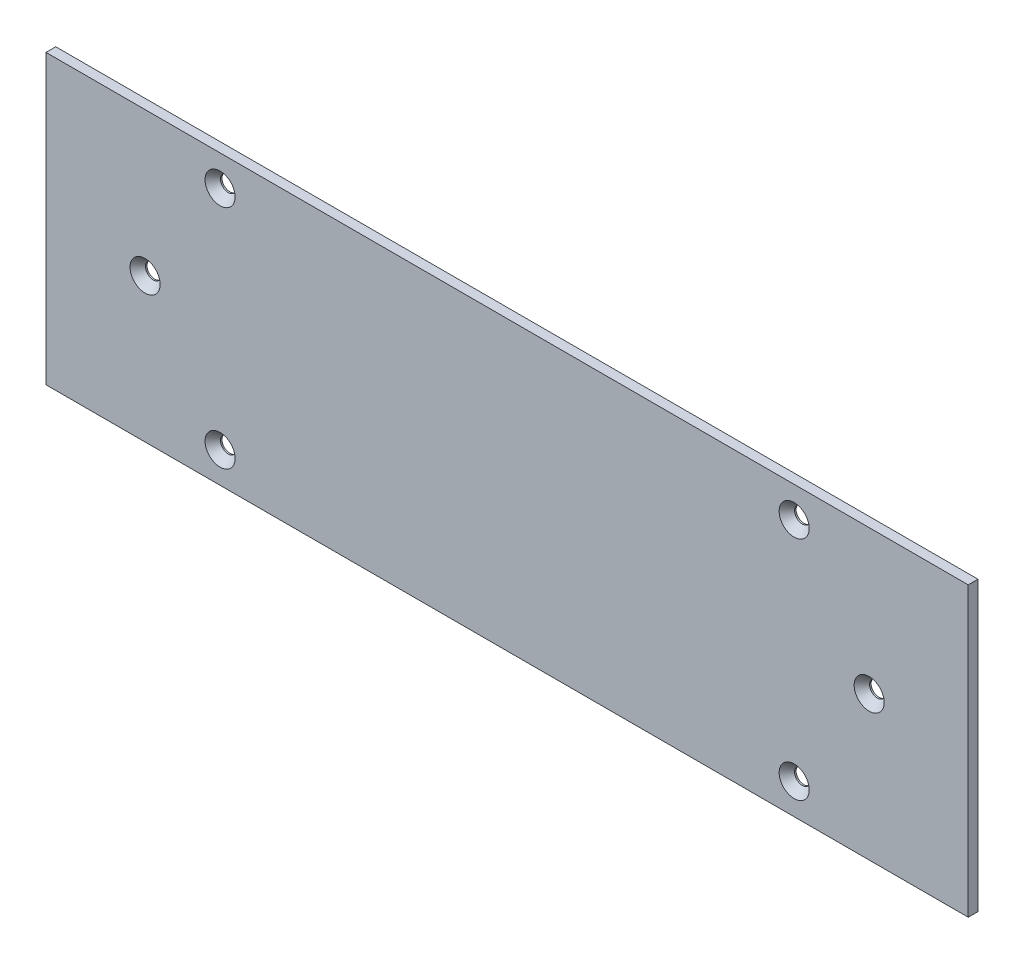
ISO-10303-21;
HEADER;
FILE_DESCRIPTION(('STEP AP214'),'2;1');
FILE_NAME('part.step','',(''),(''),'','','');
FILE_SCHEMA(('AUTOMOTIVE_DESIGN { 1 0 10303 214 1 1 1 1 }'));
ENDSEC;
DATA;
#1=APPLICATION_CONTEXT('core data for automotive mechanical design processes');
#2=APPLICATION_PROTOCOL_DEFINITION('international standard','automotive_design',2000,#1);
#3=PRODUCT_CONTEXT('',#1,'mechanical');
#4=PRODUCT('Part','Part','',(#3));
#5=PRODUCT_RELATED_PRODUCT_CATEGORY('part','',(#4));
#6=PRODUCT_DEFINITION_FORMATION('','',#4);
#7=PRODUCT_DEFINITION_CONTEXT('part definition',#1,'design');
#8=PRODUCT_DEFINITION('design','',#6,#7);
#9=PRODUCT_DEFINITION_SHAPE('','',#8);
#10=(LENGTH_UNIT() NAMED_UNIT(*) SI_UNIT(.MILLI.,.METRE.));
#11=(NAMED_UNIT(*) PLANE_ANGLE_UNIT() SI_UNIT($,.RADIAN.));
#12=(NAMED_UNIT(*) SI_UNIT($,.STERADIAN.) SOLID_ANGLE_UNIT());
#13=UNCERTAINTY_MEASURE_WITH_UNIT(LENGTH_MEASURE(1.E-05),#10,'distance_accuracy_value','');
#14=(GEOMETRIC_REPRESENTATION_CONTEXT(3) GLOBAL_UNCERTAINTY_ASSIGNED_CONTEXT((#13)) GLOBAL_UNIT_ASSIGNED_CONTEXT((#10,
#11,#12)) REPRESENTATION_CONTEXT('',''));
#15=CARTESIAN_POINT('',(0.,0.,0.));
#16=DIRECTION('',(0.,0.,1.));
#17=DIRECTION('',(1.,0.,0.));
#18=AXIS2_PLACEMENT_3D('',#15,#16,#17);
#19=CARTESIAN_POINT('',(149.999999847,-46.824999949,3.175));
#20=DIRECTION('',(-1.,0.,0.));
#21=DIRECTION('',(0.,0.,1.));
#22=AXIS2_PLACEMENT_3D('',#19,#20,#21);
#23=PLANE('',#22);
#24=DIRECTION('',(0.,1.,0.));
#25=VECTOR('',#24,1.);
#26=CARTESIAN_POINT('',(149.999999847,-46.824999949,0.));
#27=LINE('',#26,#25);
#28=CARTESIAN_POINT('',(149.999999847,-46.824999949,0.));
#29=VERTEX_POINT('',#28);
#30=CARTESIAN_POINT('',(149.999999847,46.824999949,0.));
#31=VERTEX_POINT('',#30);
#32=EDGE_CURVE('E105',#29,#31,#27,.T.);
#33=ORIENTED_EDGE('',*,*,#32,.T.);
#34=DIRECTION('',(0.,0.,-1.));
#35=VECTOR('',#34,1.);
#36=CARTESIAN_POINT('',(149.999999847,46.824999949,3.175));
#37=LINE('',#36,#35);
#38=CARTESIAN_POINT('',(149.999999847,46.824999949,3.175));
#39=VERTEX_POINT('',#38);
#40=EDGE_CURVE('E11',#39,#31,#37,.T.);
#41=ORIENTED_EDGE('',*,*,#40,.F.);
#42=DIRECTION('',(0.,1.,0.));
#43=VECTOR('',#42,1.);
#44=CARTESIAN_POINT('',(149.999999847,-46.824999949,3.175));
#45=LINE('',#44,#43);
#46=CARTESIAN_POINT('',(149.999999847,-46.824999949,3.175));
#47=VERTEX_POINT('',#46);
#48=EDGE_CURVE('E92',#47,#39,#45,.T.);
#49=ORIENTED_EDGE('',*,*,#48,.F.);
#50=DIRECTION('',(0.,0.,-1.));
#51=VECTOR('',#50,1.);
#52=CARTESIAN_POINT('',(149.999999847,-46.824999949,3.175));
#53=LINE('',#52,#51);
#54=EDGE_CURVE('E101',#47,#29,#53,.T.);
#55=ORIENTED_EDGE('',*,*,#54,.T.);
#56=EDGE_LOOP('',(#33,#41,#49,#55));
#57=FACE_BOUND('',#56,.T.);
#58=ADVANCED_FACE('F39',(#57),#23,.F.);
#59=CARTESIAN_POINT('',(-149.999999847,46.824999949,3.175));
#60=DIRECTION('',(0.,-1.,0.));
#61=DIRECTION('',(0.,0.,-1.));
#62=AXIS2_PLACEMENT_3D('',#59,#60,#61);
#63=PLANE('',#62);
#64=DIRECTION('',(-1.,0.,0.));
#65=VECTOR('',#64,1.);
#66=CARTESIAN_POINT('',(-149.999999847,46.824999949,0.));
#67=LINE('',#66,#65);
#68=CARTESIAN_POINT('',(-149.999999847,46.824999949,0.));
#69=VERTEX_POINT('',#68);
#70=EDGE_CURVE('E96',#31,#69,#67,.T.);
#71=ORIENTED_EDGE('',*,*,#70,.T.);
#72=DIRECTION('',(0.,0.,-1.));
#73=VECTOR('',#72,1.);
#74=CARTESIAN_POINT('',(-149.999999847,46.824999949,3.175));
#75=LINE('',#74,#73);
#76=CARTESIAN_POINT('',(-149.999999847,46.824999949,3.175));
#77=VERTEX_POINT('',#76);
#78=EDGE_CURVE('E48',#77,#69,#75,.T.);
#79=ORIENTED_EDGE('',*,*,#78,.F.);
#80=DIRECTION('',(-1.,0.,0.));
#81=VECTOR('',#80,1.);
#82=CARTESIAN_POINT('',(-149.999999847,46.824999949,3.175));
#83=LINE('',#82,#81);
#84=EDGE_CURVE('E87',#39,#77,#83,.T.);
#85=ORIENTED_EDGE('',*,*,#84,.F.);
#86=ORIENTED_EDGE('',*,*,#40,.T.);
#87=EDGE_LOOP('',(#71,#79,#85,#86));
#88=FACE_BOUND('',#87,.T.);
#89=ADVANCED_FACE('F95',(#88),#63,.F.);
#90=CARTESIAN_POINT('',(-149.999999847,-46.824999949,3.175));
#91=DIRECTION('',(1.,0.,0.));
#92=DIRECTION('',(0.,0.,-1.));
#93=AXIS2_PLACEMENT_3D('',#90,#91,#92);
#94=PLANE('',#93);
#95=DIRECTION('',(0.,-1.,0.));
#96=VECTOR('',#95,1.);
#97=CARTESIAN_POINT('',(-149.999999847,-46.824999949,0.));
#98=LINE('',#97,#96);
#99=CARTESIAN_POINT('',(-149.999999847,-46.824999949,0.));
#100=VERTEX_POINT('',#99);
#101=EDGE_CURVE('E74',#69,#100,#98,.T.);
#102=ORIENTED_EDGE('',*,*,#101,.T.);
#103=DIRECTION('',(0.,0.,-1.));
#104=VECTOR('',#103,1.);
#105=CARTESIAN_POINT('',(-149.999999847,-46.824999949,3.175));
#106=LINE('',#105,#104);
#107=CARTESIAN_POINT('',(-149.999999847,-46.824999949,3.175));
#108=VERTEX_POINT('',#107);
#109=EDGE_CURVE('E97',#108,#100,#106,.T.);
#110=ORIENTED_EDGE('',*,*,#109,.F.);
#111=DIRECTION('',(0.,-1.,0.));
#112=VECTOR('',#111,1.);
#113=CARTESIAN_POINT('',(-149.999999847,-46.824999949,3.175));
#114=LINE('',#113,#112);
#115=EDGE_CURVE('E90',#77,#108,#114,.T.);
#116=ORIENTED_EDGE('',*,*,#115,.F.);
#117=ORIENTED_EDGE('',*,*,#78,.T.);
#118=EDGE_LOOP('',(#102,#110,#116,#117));
#119=FACE_BOUND('',#118,.T.);
#120=ADVANCED_FACE('F99',(#119),#94,.F.);
#121=CARTESIAN_POINT('',(-149.999999847,-46.824999949,3.175));
#122=DIRECTION('',(0.,1.,0.));
#123=DIRECTION('',(0.,0.,1.));
#124=AXIS2_PLACEMENT_3D('',#121,#122,#123);
#125=PLANE('',#124);
#126=DIRECTION('',(1.,0.,0.));
#127=VECTOR('',#126,1.);
#128=CARTESIAN_POINT('',(-149.999999847,-46.824999949,0.));
#129=LINE('',#128,#127);
#130=EDGE_CURVE('E80',#100,#29,#129,.T.);
#131=ORIENTED_EDGE('',*,*,#130,.T.);
#132=ORIENTED_EDGE('',*,*,#54,.F.);
#133=DIRECTION('',(1.,0.,0.));
#134=VECTOR('',#133,1.);
#135=CARTESIAN_POINT('',(-149.999999847,-46.824999949,3.175));
#136=LINE('',#135,#134);
#137=EDGE_CURVE('E57',#108,#47,#136,.T.);
#138=ORIENTED_EDGE('',*,*,#137,.F.);
#139=ORIENTED_EDGE('',*,*,#109,.T.);
#140=EDGE_LOOP('',(#131,#132,#138,#139));
#141=FACE_BOUND('',#140,.T.);
#142=ADVANCED_FACE('F174',(#141),#125,.F.);
#143=CARTESIAN_POINT('',(0.,0.,3.175));
#144=DIRECTION('',(0.,0.,-1.));
#145=DIRECTION('',(-1.,0.,0.));
#146=AXIS2_PLACEMENT_3D('',#143,#144,#145);
#147=PLANE('',#146);
#148=CARTESIAN_POINT('',(-117.774999847,0.,3.175));
#149=DIRECTION('',(0.,0.,1.));
#150=DIRECTION('',(1.,0.,0.));
#151=AXIS2_PLACEMENT_3D('',#148,#149,#150);
#152=CIRCLE('',#151,4.88950000000001);
#153=CARTESIAN_POINT('',(-112.885499847,0.,3.175));
#154=VERTEX_POINT('',#153);
#155=EDGE_CURVE('E319',#154,#154,#152,.T.);
#156=ORIENTED_EDGE('',*,*,#155,.F.);
#157=EDGE_LOOP('',(#156));
#158=FACE_BOUND('',#157,.T.);
#159=CARTESIAN_POINT('',(117.774999847,0.,3.175));
#160=DIRECTION('',(0.,0.,1.));
#161=DIRECTION('',(1.,0.,0.));
#162=AXIS2_PLACEMENT_3D('',#159,#160,#161);
#163=CIRCLE('',#162,4.88950000000001);
#164=CARTESIAN_POINT('',(122.664499847,0.,3.175));
#165=VERTEX_POINT('',#164);
#166=EDGE_CURVE('E140',#165,#165,#163,.T.);
#167=ORIENTED_EDGE('',*,*,#166,.F.);
#168=EDGE_LOOP('',(#167));
#169=FACE_BOUND('',#168,.T.);
#170=CARTESIAN_POINT('',(-93.3749998469957,36.824999949,3.175));
#171=DIRECTION('',(0.,0.,1.));
#172=DIRECTION('',(1.,0.,0.));
#173=AXIS2_PLACEMENT_3D('',#170,#171,#172);
#174=CIRCLE('',#173,4.88950000000001);
#175=CARTESIAN_POINT('',(-88.4854998469957,36.824999949,3.175));
#176=VERTEX_POINT('',#175);
#177=EDGE_CURVE('E133',#176,#176,#174,.T.);
#178=ORIENTED_EDGE('',*,*,#177,.F.);
#179=EDGE_LOOP('',(#178));
#180=FACE_BOUND('',#179,.T.);
#181=CARTESIAN_POINT('',(93.3749998470048,36.8249999490002,3.175));
#182=DIRECTION('',(0.,0.,1.));
#183=DIRECTION('',(1.,0.,0.));
#184=AXIS2_PLACEMENT_3D('',#181,#182,#183);
#185=CIRCLE('',#184,4.88950000000001);
#186=CARTESIAN_POINT('',(98.2644998470048,36.8249999490002,3.175));
#187=VERTEX_POINT('',#186);
#188=EDGE_CURVE('E129',#187,#187,#185,.T.);
#189=ORIENTED_EDGE('',*,*,#188,.F.);
#190=EDGE_LOOP('',(#189));
#191=FACE_BOUND('',#190,.T.);
#192=CARTESIAN_POINT('',(93.3749998470063,-36.8249999489057,3.175));
#193=DIRECTION('',(0.,0.,1.));
#194=DIRECTION('',(1.,0.,0.));
#195=AXIS2_PLACEMENT_3D('',#192,#193,#194);
#196=CIRCLE('',#195,4.88950000000001);
#197=CARTESIAN_POINT('',(98.2644998470063,-36.8249999489057,3.175));
#198=VERTEX_POINT('',#197);
#199=EDGE_CURVE('E125',#198,#198,#196,.T.);
#200=ORIENTED_EDGE('',*,*,#199,.F.);
#201=EDGE_LOOP('',(#200));
#202=FACE_BOUND('',#201,.T.);
#203=CARTESIAN_POINT('',(-93.3749998469942,-36.8249999489387,3.175));
#204=DIRECTION('',(0.,0.,1.));
#205=DIRECTION('',(1.,0.,0.));
#206=AXIS2_PLACEMENT_3D('',#203,#204,#205);
#207=CIRCLE('',#206,4.88950000000001);
#208=CARTESIAN_POINT('',(-88.4854998469942,-36.8249999489387,3.175));
#209=VERTEX_POINT('',#208);
#210=EDGE_CURVE('E120',#209,#209,#207,.T.);
#211=ORIENTED_EDGE('',*,*,#210,.F.);
#212=EDGE_LOOP('',(#211));
#213=FACE_BOUND('',#212,.T.);
#214=ORIENTED_EDGE('',*,*,#48,.T.);
#215=ORIENTED_EDGE('',*,*,#84,.T.);
#216=ORIENTED_EDGE('',*,*,#115,.T.);
#217=ORIENTED_EDGE('',*,*,#137,.T.);
#218=EDGE_LOOP('',(#214,#215,#216,#217));
#219=FACE_BOUND('',#218,.T.);
#220=ADVANCED_FACE('F88',(#158,#169,#180,#191,#202,#213,#219),#147,.F.);
#221=CARTESIAN_POINT('',(0.,0.,0.));
#222=DIRECTION('',(0.,0.,-1.));
#223=DIRECTION('',(-1.,0.,0.));
#224=AXIS2_PLACEMENT_3D('',#221,#222,#223);
#225=PLANE('',#224);
#226=CARTESIAN_POINT('',(-117.774999847,0.,0.));
#227=DIRECTION('',(0.,0.,-1.));
#228=DIRECTION('',(-1.,0.,0.));
#229=AXIS2_PLACEMENT_3D('',#226,#227,#228);
#230=CIRCLE('',#229,2.55269999999999);
#231=CARTESIAN_POINT('',(-120.327699847,0.,0.));
#232=VERTEX_POINT('',#231);
#233=EDGE_CURVE('E42',#232,#232,#230,.T.);
#234=ORIENTED_EDGE('',*,*,#233,.F.);
#235=EDGE_LOOP('',(#234));
#236=FACE_BOUND('',#235,.T.);
#237=CARTESIAN_POINT('',(117.774999847,0.,0.));
#238=DIRECTION('',(0.,0.,-1.));
#239=DIRECTION('',(-1.,0.,0.));
#240=AXIS2_PLACEMENT_3D('',#237,#238,#239);
#241=CIRCLE('',#240,2.55269999999999);
#242=CARTESIAN_POINT('',(115.222299847,0.,0.));
#243=VERTEX_POINT('',#242);
#244=EDGE_CURVE('E131',#243,#243,#241,.T.);
#245=ORIENTED_EDGE('',*,*,#244,.F.);
#246=EDGE_LOOP('',(#245));
#247=FACE_BOUND('',#246,.T.);
#248=CARTESIAN_POINT('',(-93.3749998469957,36.824999949,0.));
#249=DIRECTION('',(0.,0.,-1.));
#250=DIRECTION('',(-1.,0.,0.));
#251=AXIS2_PLACEMENT_3D('',#248,#249,#250);
#252=CIRCLE('',#251,2.5527);
#253=CARTESIAN_POINT('',(-95.9276998469957,36.824999949,0.));
#254=VERTEX_POINT('',#253);
#255=EDGE_CURVE('E127',#254,#254,#252,.T.);
#256=ORIENTED_EDGE('',*,*,#255,.F.);
#257=EDGE_LOOP('',(#256));
#258=FACE_BOUND('',#257,.T.);
#259=CARTESIAN_POINT('',(93.3749998470048,36.8249999490002,0.));
#260=DIRECTION('',(0.,0.,-1.));
#261=DIRECTION('',(-1.,0.,0.));
#262=AXIS2_PLACEMENT_3D('',#259,#260,#261);
#263=CIRCLE('',#262,2.5527);
#264=CARTESIAN_POINT('',(90.8222998470048,36.8249999490002,0.));
#265=VERTEX_POINT('',#264);
#266=EDGE_CURVE('E122',#265,#265,#263,.T.);
#267=ORIENTED_EDGE('',*,*,#266,.F.);
#268=EDGE_LOOP('',(#267));
#269=FACE_BOUND('',#268,.T.);
#270=CARTESIAN_POINT('',(93.3749998470063,-36.8249999489057,0.));
#271=DIRECTION('',(0.,0.,-1.));
#272=DIRECTION('',(-1.,0.,0.));
#273=AXIS2_PLACEMENT_3D('',#270,#271,#272);
#274=CIRCLE('',#273,2.5527);
#275=CARTESIAN_POINT('',(90.8222998470063,-36.8249999489057,0.));
#276=VERTEX_POINT('',#275);
#277=EDGE_CURVE('E117',#276,#276,#274,.T.);
#278=ORIENTED_EDGE('',*,*,#277,.F.);
#279=EDGE_LOOP('',(#278));
#280=FACE_BOUND('',#279,.T.);
#281=CARTESIAN_POINT('',(-93.3749998469942,-36.8249999489387,0.));
#282=DIRECTION('',(0.,0.,-1.));
#283=DIRECTION('',(-1.,0.,0.));
#284=AXIS2_PLACEMENT_3D('',#281,#282,#283);
#285=CIRCLE('',#284,2.5527);
#286=CARTESIAN_POINT('',(-95.9276998469942,-36.8249999489387,0.));
#287=VERTEX_POINT('',#286);
#288=EDGE_CURVE('E108',#287,#287,#285,.T.);
#289=ORIENTED_EDGE('',*,*,#288,.F.);
#290=EDGE_LOOP('',(#289));
#291=FACE_BOUND('',#290,.T.);
#292=ORIENTED_EDGE('',*,*,#32,.F.);
#293=ORIENTED_EDGE('',*,*,#130,.F.);
#294=ORIENTED_EDGE('',*,*,#101,.F.);
#295=ORIENTED_EDGE('',*,*,#70,.F.);
#296=EDGE_LOOP('',(#292,#293,#294,#295));
#297=FACE_BOUND('',#296,.T.);
#298=ADVANCED_FACE('F173',(#236,#247,#258,#269,#280,#291,#297),#225,.T.);
#299=CARTESIAN_POINT('',(-93.3749998469942,-36.8249999489387,3.175));
#300=DIRECTION('',(0.,0.,1.));
#301=DIRECTION('',(1.,0.,0.));
#302=AXIS2_PLACEMENT_3D('',#299,#300,#301);
#303=CYLINDRICAL_SURFACE('',#302,2.5527);
#304=ORIENTED_EDGE('',*,*,#288,.T.);
#305=EDGE_LOOP('',(#304));
#306=FACE_BOUND('',#305,.T.);
#307=CARTESIAN_POINT('',(-93.3749998469942,-36.8249999489387,0.486819106005945));
#308=DIRECTION('',(0.,0.,1.));
#309=DIRECTION('',(1.,0.,0.));
#310=AXIS2_PLACEMENT_3D('',#307,#308,#309);
#311=CIRCLE('',#310,2.55270000000001);
#312=CARTESIAN_POINT('',(-90.8222998469942,-36.8249999489387,0.486819106005945));
#313=VERTEX_POINT('',#312);
#314=EDGE_CURVE('E116',#313,#313,#311,.T.);
#315=ORIENTED_EDGE('',*,*,#314,.T.);
#316=EDGE_LOOP('',(#315));
#317=FACE_BOUND('',#316,.T.);
#318=ADVANCED_FACE('F163',(#306,#317),#303,.F.);
#319=CARTESIAN_POINT('',(-93.3749998469942,-36.8249999489387,3.175));
#320=DIRECTION('',(0.,0.,1.));
#321=DIRECTION('',(1.,0.,0.));
#322=AXIS2_PLACEMENT_3D('',#319,#320,#321);
#323=CONICAL_SURFACE('',#322,4.88950000000001,0.715584993317675);
#324=ORIENTED_EDGE('',*,*,#314,.F.);
#325=EDGE_LOOP('',(#324));
#326=FACE_BOUND('',#325,.T.);
#327=ORIENTED_EDGE('',*,*,#210,.T.);
#328=EDGE_LOOP('',(#327));
#329=FACE_BOUND('',#328,.T.);
#330=ADVANCED_FACE('F165',(#326,#329),#323,.F.);
#331=CARTESIAN_POINT('',(93.3749998470063,-36.8249999489057,3.175));
#332=DIRECTION('',(0.,0.,1.));
#333=DIRECTION('',(1.,0.,0.));
#334=AXIS2_PLACEMENT_3D('',#331,#332,#333);
#335=CYLINDRICAL_SURFACE('',#334,2.5527);
#336=ORIENTED_EDGE('',*,*,#277,.T.);
#337=EDGE_LOOP('',(#336));
#338=FACE_BOUND('',#337,.T.);
#339=CARTESIAN_POINT('',(93.3749998470063,-36.8249999489057,0.486819106005945));
#340=DIRECTION('',(0.,0.,1.));
#341=DIRECTION('',(1.,0.,0.));
#342=AXIS2_PLACEMENT_3D('',#339,#340,#341);
#343=CIRCLE('',#342,2.55270000000001);
#344=CARTESIAN_POINT('',(95.9276998470063,-36.8249999489057,0.486819106005945));
#345=VERTEX_POINT('',#344);
#346=EDGE_CURVE('E121',#345,#345,#343,.T.);
#347=ORIENTED_EDGE('',*,*,#346,.T.);
#348=EDGE_LOOP('',(#347));
#349=FACE_BOUND('',#348,.T.);
#350=ADVANCED_FACE('F168',(#338,#349),#335,.F.);
#351=CARTESIAN_POINT('',(93.3749998470063,-36.8249999489057,3.175));
#352=DIRECTION('',(0.,0.,1.));
#353=DIRECTION('',(1.,0.,0.));
#354=AXIS2_PLACEMENT_3D('',#351,#352,#353);
#355=CONICAL_SURFACE('',#354,4.88950000000001,0.715584993317675);
#356=ORIENTED_EDGE('',*,*,#346,.F.);
#357=EDGE_LOOP('',(#356));
#358=FACE_BOUND('',#357,.T.);
#359=ORIENTED_EDGE('',*,*,#199,.T.);
#360=EDGE_LOOP('',(#359));
#361=FACE_BOUND('',#360,.T.);
#362=ADVANCED_FACE('F226',(#358,#361),#355,.F.);
#363=CARTESIAN_POINT('',(93.3749998470048,36.8249999490002,3.175));
#364=DIRECTION('',(0.,0.,1.));
#365=DIRECTION('',(1.,0.,0.));
#366=AXIS2_PLACEMENT_3D('',#363,#364,#365);
#367=CYLINDRICAL_SURFACE('',#366,2.5527);
#368=ORIENTED_EDGE('',*,*,#266,.T.);
#369=EDGE_LOOP('',(#368));
#370=FACE_BOUND('',#369,.T.);
#371=CARTESIAN_POINT('',(93.3749998470048,36.8249999490002,0.486819106005945));
#372=DIRECTION('',(0.,0.,1.));
#373=DIRECTION('',(1.,0.,0.));
#374=AXIS2_PLACEMENT_3D('',#371,#372,#373);
#375=CIRCLE('',#374,2.55270000000001);
#376=CARTESIAN_POINT('',(95.9276998470048,36.8249999490002,0.486819106005945));
#377=VERTEX_POINT('',#376);
#378=EDGE_CURVE('E126',#377,#377,#375,.T.);
#379=ORIENTED_EDGE('',*,*,#378,.T.);
#380=EDGE_LOOP('',(#379));
#381=FACE_BOUND('',#380,.T.);
#382=ADVANCED_FACE('F235',(#370,#381),#367,.F.);
#383=CARTESIAN_POINT('',(93.3749998470048,36.8249999490002,3.175));
#384=DIRECTION('',(0.,0.,1.));
#385=DIRECTION('',(1.,0.,0.));
#386=AXIS2_PLACEMENT_3D('',#383,#384,#385);
#387=CONICAL_SURFACE('',#386,4.88950000000001,0.715584993317675);
#388=ORIENTED_EDGE('',*,*,#378,.F.);
#389=EDGE_LOOP('',(#388));
#390=FACE_BOUND('',#389,.T.);
#391=ORIENTED_EDGE('',*,*,#188,.T.);
#392=EDGE_LOOP('',(#391));
#393=FACE_BOUND('',#392,.T.);
#394=ADVANCED_FACE('F244',(#390,#393),#387,.F.);
#395=CARTESIAN_POINT('',(-93.3749998469957,36.824999949,3.175));
#396=DIRECTION('',(0.,0.,1.));
#397=DIRECTION('',(1.,0.,0.));
#398=AXIS2_PLACEMENT_3D('',#395,#396,#397);
#399=CYLINDRICAL_SURFACE('',#398,2.5527);
#400=ORIENTED_EDGE('',*,*,#255,.T.);
#401=EDGE_LOOP('',(#400));
#402=FACE_BOUND('',#401,.T.);
#403=CARTESIAN_POINT('',(-93.3749998469957,36.824999949,0.486819106005945));
#404=DIRECTION('',(0.,0.,1.));
#405=DIRECTION('',(1.,0.,0.));
#406=AXIS2_PLACEMENT_3D('',#403,#404,#405);
#407=CIRCLE('',#406,2.55270000000001);
#408=CARTESIAN_POINT('',(-90.8222998469957,36.824999949,0.486819106005945));
#409=VERTEX_POINT('',#408);
#410=EDGE_CURVE('E130',#409,#409,#407,.T.);
#411=ORIENTED_EDGE('',*,*,#410,.T.);
#412=EDGE_LOOP('',(#411));
#413=FACE_BOUND('',#412,.T.);
#414=ADVANCED_FACE('F253',(#402,#413),#399,.F.);
#415=CARTESIAN_POINT('',(-93.3749998469957,36.824999949,3.175));
#416=DIRECTION('',(0.,0.,1.));
#417=DIRECTION('',(1.,0.,0.));
#418=AXIS2_PLACEMENT_3D('',#415,#416,#417);
#419=CONICAL_SURFACE('',#418,4.88950000000001,0.715584993317675);
#420=ORIENTED_EDGE('',*,*,#410,.F.);
#421=EDGE_LOOP('',(#420));
#422=FACE_BOUND('',#421,.T.);
#423=ORIENTED_EDGE('',*,*,#177,.T.);
#424=EDGE_LOOP('',(#423));
#425=FACE_BOUND('',#424,.T.);
#426=ADVANCED_FACE('F261',(#422,#425),#419,.F.);
#427=CARTESIAN_POINT('',(117.774999847,0.,3.175));
#428=DIRECTION('',(0.,0.,1.));
#429=DIRECTION('',(1.,0.,0.));
#430=AXIS2_PLACEMENT_3D('',#427,#428,#429);
#431=CYLINDRICAL_SURFACE('',#430,2.55269999999999);
#432=ORIENTED_EDGE('',*,*,#244,.T.);
#433=EDGE_LOOP('',(#432));
#434=FACE_BOUND('',#433,.T.);
#435=CARTESIAN_POINT('',(117.774999847,0.,0.486819106005928));
#436=DIRECTION('',(0.,0.,1.));
#437=DIRECTION('',(1.,0.,0.));
#438=AXIS2_PLACEMENT_3D('',#435,#436,#437);
#439=CIRCLE('',#438,2.55269999999999);
#440=CARTESIAN_POINT('',(120.327699847,0.,0.486819106005928));
#441=VERTEX_POINT('',#440);
#442=EDGE_CURVE('E134',#441,#441,#439,.T.);
#443=ORIENTED_EDGE('',*,*,#442,.T.);
#444=EDGE_LOOP('',(#443));
#445=FACE_BOUND('',#444,.T.);
#446=ADVANCED_FACE('F269',(#434,#445),#431,.F.);
#447=CARTESIAN_POINT('',(117.774999847,0.,3.175));
#448=DIRECTION('',(0.,0.,1.));
#449=DIRECTION('',(1.,0.,0.));
#450=AXIS2_PLACEMENT_3D('',#447,#448,#449);
#451=CONICAL_SURFACE('',#450,4.88950000000001,0.715584993317675);
#452=ORIENTED_EDGE('',*,*,#442,.F.);
#453=EDGE_LOOP('',(#452));
#454=FACE_BOUND('',#453,.T.);
#455=ORIENTED_EDGE('',*,*,#166,.T.);
#456=EDGE_LOOP('',(#455));
#457=FACE_BOUND('',#456,.T.);
#458=ADVANCED_FACE('F282',(#454,#457),#451,.F.);
#459=CARTESIAN_POINT('',(-117.774999847,0.,3.175));
#460=DIRECTION('',(0.,0.,1.));
#461=DIRECTION('',(1.,0.,0.));
#462=AXIS2_PLACEMENT_3D('',#459,#460,#461);
#463=CYLINDRICAL_SURFACE('',#462,2.55269999999999);
#464=ORIENTED_EDGE('',*,*,#233,.T.);
#465=EDGE_LOOP('',(#464));
#466=FACE_BOUND('',#465,.T.);
#467=CARTESIAN_POINT('',(-117.774999847,0.,0.486819106005928));
#468=DIRECTION('',(0.,0.,1.));
#469=DIRECTION('',(1.,0.,0.));
#470=AXIS2_PLACEMENT_3D('',#467,#468,#469);
#471=CIRCLE('',#470,2.55269999999999);
#472=CARTESIAN_POINT('',(-115.222299847,0.,0.486819106005928));
#473=VERTEX_POINT('',#472);
#474=EDGE_CURVE('E317',#473,#473,#471,.T.);
#475=ORIENTED_EDGE('',*,*,#474,.T.);
#476=EDGE_LOOP('',(#475));
#477=FACE_BOUND('',#476,.T.);
#478=ADVANCED_FACE('F291',(#466,#477),#463,.F.);
#479=CARTESIAN_POINT('',(-117.774999847,0.,3.175));
#480=DIRECTION('',(0.,0.,1.));
#481=DIRECTION('',(1.,0.,0.));
#482=AXIS2_PLACEMENT_3D('',#479,#480,#481);
#483=CONICAL_SURFACE('',#482,4.88950000000001,0.715584993317675);
#484=ORIENTED_EDGE('',*,*,#474,.F.);
#485=EDGE_LOOP('',(#484));
#486=FACE_BOUND('',#485,.T.);
#487=ORIENTED_EDGE('',*,*,#155,.T.);
#488=EDGE_LOOP('',(#487));
#489=FACE_BOUND('',#488,.T.);
#490=ADVANCED_FACE('F301',(#486,#489),#483,.F.);
#491=CLOSED_SHELL('',(#58,#89,#120,#142,#220,#298,#318,#330,#350,#362,#382,#394,#414,#426,#446,
#458,#478,#490));
#492=MANIFOLD_SOLID_BREP('B2',#491);
#493=ADVANCED_BREP_SHAPE_REPRESENTATION('',(#18,#492),#14);
#494=SHAPE_DEFINITION_REPRESENTATION(#9,#493);
ENDSEC;
END-ISO-10303-21;
